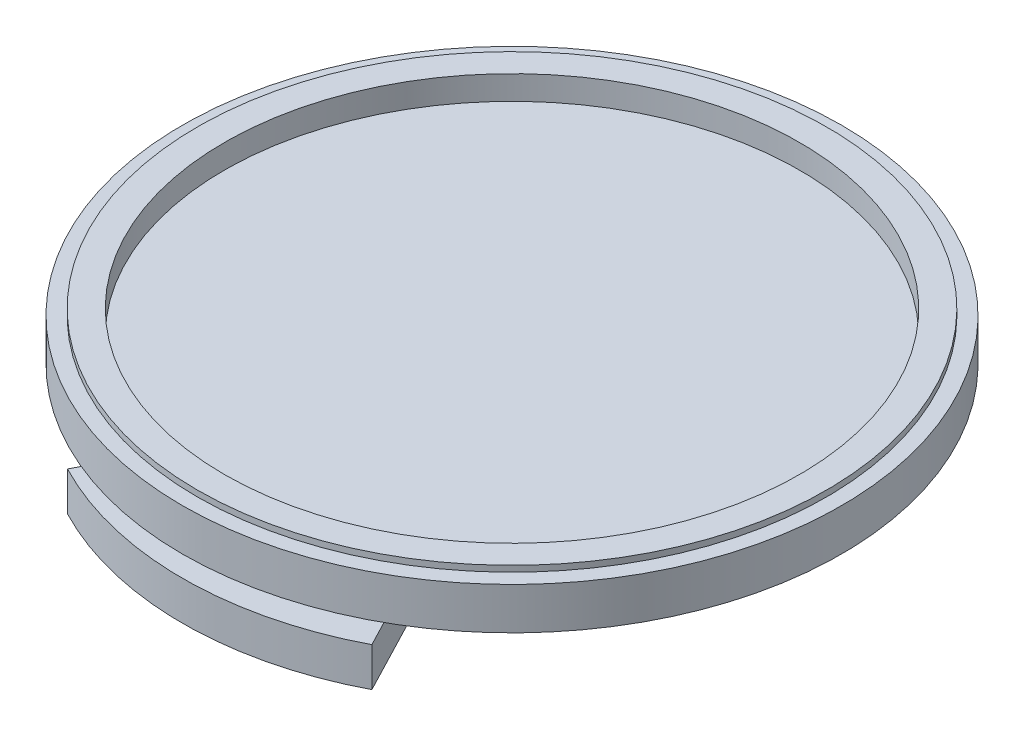
ISO-10303-21;
HEADER;
FILE_DESCRIPTION(('STEP AP214'),'2;1');
FILE_NAME('part.step','',(''),(''),'','','');
FILE_SCHEMA(('AUTOMOTIVE_DESIGN { 1 0 10303 214 1 1 1 1 }'));
ENDSEC;
DATA;
#1=APPLICATION_CONTEXT('core data for automotive mechanical design processes');
#2=APPLICATION_PROTOCOL_DEFINITION('international standard','automotive_design',2000,#1);
#3=PRODUCT_CONTEXT('',#1,'mechanical');
#4=PRODUCT('Part','Part','',(#3));
#5=PRODUCT_RELATED_PRODUCT_CATEGORY('part','',(#4));
#6=PRODUCT_DEFINITION_FORMATION('','',#4);
#7=PRODUCT_DEFINITION_CONTEXT('part definition',#1,'design');
#8=PRODUCT_DEFINITION('design','',#6,#7);
#9=PRODUCT_DEFINITION_SHAPE('','',#8);
#10=(LENGTH_UNIT() NAMED_UNIT(*) SI_UNIT(.MILLI.,.METRE.));
#11=(NAMED_UNIT(*) PLANE_ANGLE_UNIT() SI_UNIT($,.RADIAN.));
#12=(NAMED_UNIT(*) SI_UNIT($,.STERADIAN.) SOLID_ANGLE_UNIT());
#13=UNCERTAINTY_MEASURE_WITH_UNIT(LENGTH_MEASURE(1.E-05),#10,'distance_accuracy_value','');
#14=(GEOMETRIC_REPRESENTATION_CONTEXT(3) GLOBAL_UNCERTAINTY_ASSIGNED_CONTEXT((#13)) GLOBAL_UNIT_ASSIGNED_CONTEXT((#10,
#11,#12)) REPRESENTATION_CONTEXT('',''));
#15=CARTESIAN_POINT('',(0.,0.,0.));
#16=DIRECTION('',(0.,0.,1.));
#17=DIRECTION('',(1.,0.,0.));
#18=AXIS2_PLACEMENT_3D('',#15,#16,#17);
#19=CARTESIAN_POINT('',(0.,1.651,-6.6548));
#20=DIRECTION('',(0.,1.,0.));
#21=DIRECTION('',(0.,0.,1.));
#22=AXIS2_PLACEMENT_3D('',#19,#20,#21);
#23=PLANE('',#22);
#24=CARTESIAN_POINT('',(0.,1.651,0.));
#25=DIRECTION('',(0.,1.,0.));
#26=DIRECTION('',(0.,0.,1.));
#27=AXIS2_PLACEMENT_3D('',#24,#25,#26);
#28=CIRCLE('',#27,6.6548);
#29=CARTESIAN_POINT('',(0.,1.651,6.6548));
#30=VERTEX_POINT('',#29);
#31=EDGE_CURVE('E43',#30,#30,#28,.T.);
#32=ORIENTED_EDGE('',*,*,#31,.T.);
#33=EDGE_LOOP('',(#32));
#34=FACE_BOUND('',#33,.T.);
#35=DIRECTION('',(0.461748613235032,0.,0.887010833178223));
#36=VECTOR('',#35,1.);
#37=CARTESIAN_POINT('',(3.87037687613604,1.651,7.43492480369987));
#38=LINE('',#37,#36);
#39=CARTESIAN_POINT('',(3.87037687613604,1.651,7.43492480369986));
#40=VERTEX_POINT('',#39);
#41=CARTESIAN_POINT('',(5.78210848465172,1.651,11.1073270552243));
#42=VERTEX_POINT('',#41);
#43=EDGE_CURVE('E50',#40,#42,#38,.T.);
#44=ORIENTED_EDGE('',*,*,#43,.F.);
#45=CARTESIAN_POINT('',(0.,1.651,0.));
#46=DIRECTION('',(0.,1.,0.));
#47=DIRECTION('',(0.,0.,1.));
#48=AXIS2_PLACEMENT_3D('',#45,#46,#47);
#49=CIRCLE('',#48,8.382);
#50=CARTESIAN_POINT('',(-3.87037687613604,1.651,7.43492480369987));
#51=VERTEX_POINT('',#50);
#52=EDGE_CURVE('E98',#51,#40,#49,.T.);
#53=ORIENTED_EDGE('',*,*,#52,.F.);
#54=DIRECTION('',(0.461748613235032,0.,-0.887010833178223));
#55=VECTOR('',#54,1.);
#56=CARTESIAN_POINT('',(-3.87037687613604,1.651,7.43492480369987));
#57=LINE('',#56,#55);
#58=CARTESIAN_POINT('',(-5.78210848465172,1.651,11.1073270552243));
#59=VERTEX_POINT('',#58);
#60=EDGE_CURVE('E99',#59,#51,#57,.T.);
#61=ORIENTED_EDGE('',*,*,#60,.F.);
#62=CARTESIAN_POINT('',(0.,1.651,0.));
#63=DIRECTION('',(0.,1.,0.));
#64=DIRECTION('',(0.,0.,1.));
#65=AXIS2_PLACEMENT_3D('',#62,#63,#64);
#66=CIRCLE('',#65,12.5222);
#67=EDGE_CURVE('E143',#42,#59,#66,.T.);
#68=ORIENTED_EDGE('',*,*,#67,.F.);
#69=EDGE_LOOP('',(#44,#53,#61,#68));
#70=FACE_BOUND('',#69,.T.);
#71=ADVANCED_FACE('F35',(#34,#70),#23,.F.);
#72=CARTESIAN_POINT('',(0.,0.,0.));
#73=DIRECTION('',(0.,1.,0.));
#74=DIRECTION('',(0.,0.,1.));
#75=AXIS2_PLACEMENT_3D('',#72,#73,#74);
#76=PLANE('',#75);
#77=CARTESIAN_POINT('',(0.,0.,0.));
#78=DIRECTION('',(0.,1.,0.));
#79=DIRECTION('',(0.,0.,1.));
#80=AXIS2_PLACEMENT_3D('',#77,#78,#79);
#81=CIRCLE('',#80,6.6548);
#82=CARTESIAN_POINT('',(0.,0.,6.6548));
#83=VERTEX_POINT('',#82);
#84=EDGE_CURVE('E11',#83,#83,#81,.T.);
#85=ORIENTED_EDGE('',*,*,#84,.F.);
#86=EDGE_LOOP('',(#85));
#87=FACE_BOUND('',#86,.T.);
#88=ADVANCED_FACE('F37',(#87),#76,.F.);
#89=CARTESIAN_POINT('',(0.,3.556,0.));
#90=DIRECTION('',(0.,1.,0.));
#91=DIRECTION('',(0.,0.,1.));
#92=AXIS2_PLACEMENT_3D('',#89,#90,#91);
#93=CYLINDRICAL_SURFACE('',#92,6.6548);
#94=ORIENTED_EDGE('',*,*,#31,.F.);
#95=EDGE_LOOP('',(#94));
#96=FACE_BOUND('',#95,.T.);
#97=ORIENTED_EDGE('',*,*,#84,.T.);
#98=EDGE_LOOP('',(#97));
#99=FACE_BOUND('',#98,.T.);
#100=ADVANCED_FACE('F150',(#96,#99),#93,.T.);
#101=CARTESIAN_POINT('',(0.,3.556,0.));
#102=DIRECTION('',(0.,1.,0.));
#103=DIRECTION('',(0.,0.,1.));
#104=AXIS2_PLACEMENT_3D('',#101,#102,#103);
#105=CYLINDRICAL_SURFACE('',#104,12.5222);
#106=CARTESIAN_POINT('',(0.,2.54,0.));
#107=DIRECTION('',(0.,1.,0.));
#108=DIRECTION('',(0.,0.,1.));
#109=AXIS2_PLACEMENT_3D('',#106,#107,#108);
#110=CIRCLE('',#109,12.5222);
#111=CARTESIAN_POINT('',(0.,2.54,12.5222));
#112=VERTEX_POINT('',#111);
#113=EDGE_CURVE('E140',#112,#112,#110,.T.);
#114=ORIENTED_EDGE('',*,*,#113,.F.);
#115=EDGE_LOOP('',(#114));
#116=FACE_BOUND('',#115,.T.);
#117=ORIENTED_EDGE('',*,*,#67,.T.);
#118=EDGE_CURVE('E57',#59,#42,#66,.T.);
#119=ORIENTED_EDGE('',*,*,#118,.T.);
#120=EDGE_LOOP('',(#117,#119));
#121=FACE_BOUND('',#120,.T.);
#122=ADVANCED_FACE('F153',(#116,#121),#105,.T.);
#123=CARTESIAN_POINT('',(0.,2.54,-12.5222));
#124=DIRECTION('',(0.,1.,0.));
#125=DIRECTION('',(0.,0.,1.));
#126=AXIS2_PLACEMENT_3D('',#123,#124,#125);
#127=PLANE('',#126);
#128=CARTESIAN_POINT('',(0.,2.54,0.));
#129=DIRECTION('',(0.,1.,0.));
#130=DIRECTION('',(0.,0.,1.));
#131=AXIS2_PLACEMENT_3D('',#128,#129,#130);
#132=CIRCLE('',#131,13.97);
#133=CARTESIAN_POINT('',(0.,2.54,13.97));
#134=VERTEX_POINT('',#133);
#135=EDGE_CURVE('E137',#134,#134,#132,.T.);
#136=ORIENTED_EDGE('',*,*,#135,.F.);
#137=EDGE_LOOP('',(#136));
#138=FACE_BOUND('',#137,.T.);
#139=ORIENTED_EDGE('',*,*,#113,.T.);
#140=EDGE_LOOP('',(#139));
#141=FACE_BOUND('',#140,.T.);
#142=ADVANCED_FACE('F166',(#138,#141),#127,.F.);
#143=CARTESIAN_POINT('',(0.,3.556,0.));
#144=DIRECTION('',(0.,1.,0.));
#145=DIRECTION('',(0.,0.,1.));
#146=AXIS2_PLACEMENT_3D('',#143,#144,#145);
#147=CYLINDRICAL_SURFACE('',#146,13.97);
#148=CARTESIAN_POINT('',(0.,4.318,0.));
#149=DIRECTION('',(0.,1.,0.));
#150=DIRECTION('',(0.,0.,1.));
#151=AXIS2_PLACEMENT_3D('',#148,#149,#150);
#152=CIRCLE('',#151,13.97);
#153=CARTESIAN_POINT('',(0.,4.318,13.97));
#154=VERTEX_POINT('',#153);
#155=EDGE_CURVE('E134',#154,#154,#152,.T.);
#156=ORIENTED_EDGE('',*,*,#155,.F.);
#157=EDGE_LOOP('',(#156));
#158=FACE_BOUND('',#157,.T.);
#159=ORIENTED_EDGE('',*,*,#135,.T.);
#160=EDGE_LOOP('',(#159));
#161=FACE_BOUND('',#160,.T.);
#162=ADVANCED_FACE('F170',(#158,#161),#147,.T.);
#163=CARTESIAN_POINT('',(0.,4.318,-13.97));
#164=DIRECTION('',(0.,-1.,0.));
#165=DIRECTION('',(0.,0.,-1.));
#166=AXIS2_PLACEMENT_3D('',#163,#164,#165);
#167=PLANE('',#166);
#168=CARTESIAN_POINT('',(0.,4.318,0.));
#169=DIRECTION('',(0.,1.,0.));
#170=DIRECTION('',(0.,0.,1.));
#171=AXIS2_PLACEMENT_3D('',#168,#169,#170);
#172=CIRCLE('',#171,13.335);
#173=CARTESIAN_POINT('',(0.,4.318,13.335));
#174=VERTEX_POINT('',#173);
#175=EDGE_CURVE('E131',#174,#174,#172,.T.);
#176=ORIENTED_EDGE('',*,*,#175,.F.);
#177=EDGE_LOOP('',(#176));
#178=FACE_BOUND('',#177,.T.);
#179=ORIENTED_EDGE('',*,*,#155,.T.);
#180=EDGE_LOOP('',(#179));
#181=FACE_BOUND('',#180,.T.);
#182=ADVANCED_FACE('F174',(#178,#181),#167,.F.);
#183=CARTESIAN_POINT('',(0.,3.556,0.));
#184=DIRECTION('',(0.,1.,0.));
#185=DIRECTION('',(0.,0.,1.));
#186=AXIS2_PLACEMENT_3D('',#183,#184,#185);
#187=CYLINDRICAL_SURFACE('',#186,13.335);
#188=CARTESIAN_POINT('',(0.,4.572,0.));
#189=DIRECTION('',(0.,1.,0.));
#190=DIRECTION('',(0.,0.,1.));
#191=AXIS2_PLACEMENT_3D('',#188,#189,#190);
#192=CIRCLE('',#191,13.335);
#193=CARTESIAN_POINT('',(0.,4.572,13.335));
#194=VERTEX_POINT('',#193);
#195=EDGE_CURVE('E128',#194,#194,#192,.T.);
#196=ORIENTED_EDGE('',*,*,#195,.F.);
#197=EDGE_LOOP('',(#196));
#198=FACE_BOUND('',#197,.T.);
#199=ORIENTED_EDGE('',*,*,#175,.T.);
#200=EDGE_LOOP('',(#199));
#201=FACE_BOUND('',#200,.T.);
#202=ADVANCED_FACE('F178',(#198,#201),#187,.T.);
#203=CARTESIAN_POINT('',(0.,4.572,-13.335));
#204=DIRECTION('',(0.,-1.,0.));
#205=DIRECTION('',(0.,0.,-1.));
#206=AXIS2_PLACEMENT_3D('',#203,#204,#205);
#207=PLANE('',#206);
#208=CARTESIAN_POINT('',(0.,4.572,0.));
#209=DIRECTION('',(0.,1.,0.));
#210=DIRECTION('',(0.,0.,1.));
#211=AXIS2_PLACEMENT_3D('',#208,#209,#210);
#212=CIRCLE('',#211,12.192);
#213=CARTESIAN_POINT('',(0.,4.572,12.192));
#214=VERTEX_POINT('',#213);
#215=EDGE_CURVE('E125',#214,#214,#212,.T.);
#216=ORIENTED_EDGE('',*,*,#215,.F.);
#217=EDGE_LOOP('',(#216));
#218=FACE_BOUND('',#217,.T.);
#219=ORIENTED_EDGE('',*,*,#195,.T.);
#220=EDGE_LOOP('',(#219));
#221=FACE_BOUND('',#220,.T.);
#222=ADVANCED_FACE('F182',(#218,#221),#207,.F.);
#223=CARTESIAN_POINT('',(0.,3.556,0.));
#224=DIRECTION('',(0.,1.,0.));
#225=DIRECTION('',(0.,0.,1.));
#226=AXIS2_PLACEMENT_3D('',#223,#224,#225);
#227=CYLINDRICAL_SURFACE('',#226,12.192);
#228=CARTESIAN_POINT('',(0.,3.556,0.));
#229=DIRECTION('',(0.,1.,0.));
#230=DIRECTION('',(0.,0.,1.));
#231=AXIS2_PLACEMENT_3D('',#228,#229,#230);
#232=CIRCLE('',#231,12.192);
#233=CARTESIAN_POINT('',(0.,3.556,12.192));
#234=VERTEX_POINT('',#233);
#235=EDGE_CURVE('E122',#234,#234,#232,.T.);
#236=ORIENTED_EDGE('',*,*,#235,.F.);
#237=EDGE_LOOP('',(#236));
#238=FACE_BOUND('',#237,.T.);
#239=ORIENTED_EDGE('',*,*,#215,.T.);
#240=EDGE_LOOP('',(#239));
#241=FACE_BOUND('',#240,.T.);
#242=ADVANCED_FACE('F186',(#238,#241),#227,.F.);
#243=CARTESIAN_POINT('',(0.,3.556,-12.192));
#244=DIRECTION('',(0.,-1.,0.));
#245=DIRECTION('',(0.,0.,-1.));
#246=AXIS2_PLACEMENT_3D('',#243,#244,#245);
#247=PLANE('',#246);
#248=ORIENTED_EDGE('',*,*,#235,.T.);
#249=EDGE_LOOP('',(#248));
#250=FACE_BOUND('',#249,.T.);
#251=ADVANCED_FACE('F190',(#250),#247,.F.);
#252=CARTESIAN_POINT('',(0.,1.651,0.));
#253=DIRECTION('',(0.,1.,0.));
#254=DIRECTION('',(0.,0.,1.));
#255=AXIS2_PLACEMENT_3D('',#252,#253,#254);
#256=PLANE('',#255);
#257=ORIENTED_EDGE('',*,*,#118,.F.);
#258=CARTESIAN_POINT('',(-6.4506281268934,1.651,12.3915413394998));
#259=VERTEX_POINT('',#258);
#260=EDGE_CURVE('E86',#259,#59,#57,.T.);
#261=ORIENTED_EDGE('',*,*,#260,.F.);
#262=CARTESIAN_POINT('',(0.,1.651,0.));
#263=DIRECTION('',(0.,-1.,0.));
#264=DIRECTION('',(0.,0.,1.));
#265=AXIS2_PLACEMENT_3D('',#262,#263,#264);
#266=CIRCLE('',#265,13.97);
#267=CARTESIAN_POINT('',(6.4506281268934,1.651,12.3915413394998));
#268=VERTEX_POINT('',#267);
#269=EDGE_CURVE('E97',#268,#259,#266,.T.);
#270=ORIENTED_EDGE('',*,*,#269,.F.);
#271=EDGE_CURVE('E112',#42,#268,#38,.T.);
#272=ORIENTED_EDGE('',*,*,#271,.F.);
#273=EDGE_LOOP('',(#257,#261,#270,#272));
#274=FACE_BOUND('',#273,.T.);
#275=ADVANCED_FACE('F96',(#274),#256,.T.);
#276=CARTESIAN_POINT('',(3.87037687613604,-14.4620061107431,7.43492480369987));
#277=DIRECTION('',(-0.887010833178223,0.,0.461748613235032));
#278=DIRECTION('',(0.461748613235032,0.,0.887010833178223));
#279=AXIS2_PLACEMENT_3D('',#276,#277,#278);
#280=PLANE('',#279);
#281=DIRECTION('',(0.,1.,0.));
#282=VECTOR('',#281,1.);
#283=CARTESIAN_POINT('',(6.4506281268934,-14.4620061107431,12.3915413394998));
#284=LINE('',#283,#282);
#285=CARTESIAN_POINT('',(6.4506281268934,0.,12.3915413394998));
#286=VERTEX_POINT('',#285);
#287=EDGE_CURVE('E104',#286,#268,#284,.T.);
#288=ORIENTED_EDGE('',*,*,#287,.F.);
#289=DIRECTION('',(-0.461748613235032,0.,-0.887010833178223));
#290=VECTOR('',#289,1.);
#291=CARTESIAN_POINT('',(3.87037687613604,0.,7.43492480369987));
#292=LINE('',#291,#290);
#293=CARTESIAN_POINT('',(3.87037687613604,0.,7.43492480369986));
#294=VERTEX_POINT('',#293);
#295=EDGE_CURVE('E92',#286,#294,#292,.T.);
#296=ORIENTED_EDGE('',*,*,#295,.T.);
#297=DIRECTION('',(0.,1.,0.));
#298=VECTOR('',#297,1.);
#299=CARTESIAN_POINT('',(3.87037687613604,-14.4620061107431,7.43492480369986));
#300=LINE('',#299,#298);
#301=EDGE_CURVE('E115',#294,#40,#300,.T.);
#302=ORIENTED_EDGE('',*,*,#301,.T.);
#303=ORIENTED_EDGE('',*,*,#43,.T.);
#304=ORIENTED_EDGE('',*,*,#271,.T.);
#305=EDGE_LOOP('',(#288,#296,#302,#303,#304));
#306=FACE_BOUND('',#305,.T.);
#307=ADVANCED_FACE('F203',(#306),#280,.F.);
#308=CARTESIAN_POINT('',(0.,-14.4620061107431,0.));
#309=DIRECTION('',(0.,1.,0.));
#310=DIRECTION('',(0.,0.,1.));
#311=AXIS2_PLACEMENT_3D('',#308,#309,#310);
#312=CYLINDRICAL_SURFACE('',#311,8.382);
#313=ORIENTED_EDGE('',*,*,#301,.F.);
#314=CARTESIAN_POINT('',(0.,0.,0.));
#315=DIRECTION('',(0.,1.,0.));
#316=DIRECTION('',(0.,0.,1.));
#317=AXIS2_PLACEMENT_3D('',#314,#315,#316);
#318=CIRCLE('',#317,8.382);
#319=CARTESIAN_POINT('',(-3.87037687613604,0.,7.43492480369987));
#320=VERTEX_POINT('',#319);
#321=EDGE_CURVE('E121',#294,#320,#318,.F.);
#322=ORIENTED_EDGE('',*,*,#321,.T.);
#323=DIRECTION('',(0.,1.,0.));
#324=VECTOR('',#323,1.);
#325=CARTESIAN_POINT('',(-3.87037687613604,-14.4620061107431,7.43492480369987));
#326=LINE('',#325,#324);
#327=EDGE_CURVE('E93',#320,#51,#326,.T.);
#328=ORIENTED_EDGE('',*,*,#327,.T.);
#329=ORIENTED_EDGE('',*,*,#52,.T.);
#330=EDGE_LOOP('',(#313,#322,#328,#329));
#331=FACE_BOUND('',#330,.T.);
#332=ADVANCED_FACE('F200',(#331),#312,.F.);
#333=CARTESIAN_POINT('',(-3.87037687613604,-14.4620061107431,7.43492480369987));
#334=DIRECTION('',(0.887010833178223,0.,0.461748613235032));
#335=DIRECTION('',(0.461748613235032,0.,-0.887010833178223));
#336=AXIS2_PLACEMENT_3D('',#333,#334,#335);
#337=PLANE('',#336);
#338=ORIENTED_EDGE('',*,*,#327,.F.);
#339=DIRECTION('',(-0.461748613235032,0.,0.887010833178223));
#340=VECTOR('',#339,1.);
#341=CARTESIAN_POINT('',(-3.87037687613604,0.,7.43492480369987));
#342=LINE('',#341,#340);
#343=CARTESIAN_POINT('',(-6.4506281268934,0.,12.3915413394998));
#344=VERTEX_POINT('',#343);
#345=EDGE_CURVE('E88',#320,#344,#342,.T.);
#346=ORIENTED_EDGE('',*,*,#345,.T.);
#347=DIRECTION('',(0.,1.,0.));
#348=VECTOR('',#347,1.);
#349=CARTESIAN_POINT('',(-6.4506281268934,-14.4620061107431,12.3915413394998));
#350=LINE('',#349,#348);
#351=EDGE_CURVE('E83',#344,#259,#350,.T.);
#352=ORIENTED_EDGE('',*,*,#351,.T.);
#353=ORIENTED_EDGE('',*,*,#260,.T.);
#354=ORIENTED_EDGE('',*,*,#60,.T.);
#355=EDGE_LOOP('',(#338,#346,#352,#353,#354));
#356=FACE_BOUND('',#355,.T.);
#357=ADVANCED_FACE('F85',(#356),#337,.F.);
#358=CARTESIAN_POINT('',(0.,-14.4620061107431,0.));
#359=DIRECTION('',(0.,1.,0.));
#360=DIRECTION('',(0.,0.,1.));
#361=AXIS2_PLACEMENT_3D('',#358,#359,#360);
#362=CYLINDRICAL_SURFACE('',#361,13.97);
#363=ORIENTED_EDGE('',*,*,#351,.F.);
#364=CARTESIAN_POINT('',(0.,0.,0.));
#365=DIRECTION('',(0.,1.,0.));
#366=DIRECTION('',(0.,0.,1.));
#367=AXIS2_PLACEMENT_3D('',#364,#365,#366);
#368=CIRCLE('',#367,13.97);
#369=EDGE_CURVE('E107',#344,#286,#368,.T.);
#370=ORIENTED_EDGE('',*,*,#369,.T.);
#371=ORIENTED_EDGE('',*,*,#287,.T.);
#372=ORIENTED_EDGE('',*,*,#269,.T.);
#373=EDGE_LOOP('',(#363,#370,#371,#372));
#374=FACE_BOUND('',#373,.T.);
#375=ADVANCED_FACE('F102',(#374),#362,.T.);
#376=CARTESIAN_POINT('',(0.,0.,0.));
#377=DIRECTION('',(0.,1.,0.));
#378=DIRECTION('',(0.,0.,1.));
#379=AXIS2_PLACEMENT_3D('',#376,#377,#378);
#380=PLANE('',#379);
#381=ORIENTED_EDGE('',*,*,#345,.F.);
#382=ORIENTED_EDGE('',*,*,#321,.F.);
#383=ORIENTED_EDGE('',*,*,#295,.F.);
#384=ORIENTED_EDGE('',*,*,#369,.F.);
#385=EDGE_LOOP('',(#381,#382,#383,#384));
#386=FACE_BOUND('',#385,.T.);
#387=ADVANCED_FACE('F197',(#386),#380,.F.);
#388=CLOSED_SHELL('',(#71,#88,#100,#122,#142,#162,#182,#202,#222,#242,#251,#275,#307,#332,#357,
#375,#387));
#389=MANIFOLD_SOLID_BREP('B2',#388);
#390=ADVANCED_BREP_SHAPE_REPRESENTATION('',(#18,#389),#14);
#391=SHAPE_DEFINITION_REPRESENTATION(#9,#390);
ENDSEC;
END-ISO-10303-21;
